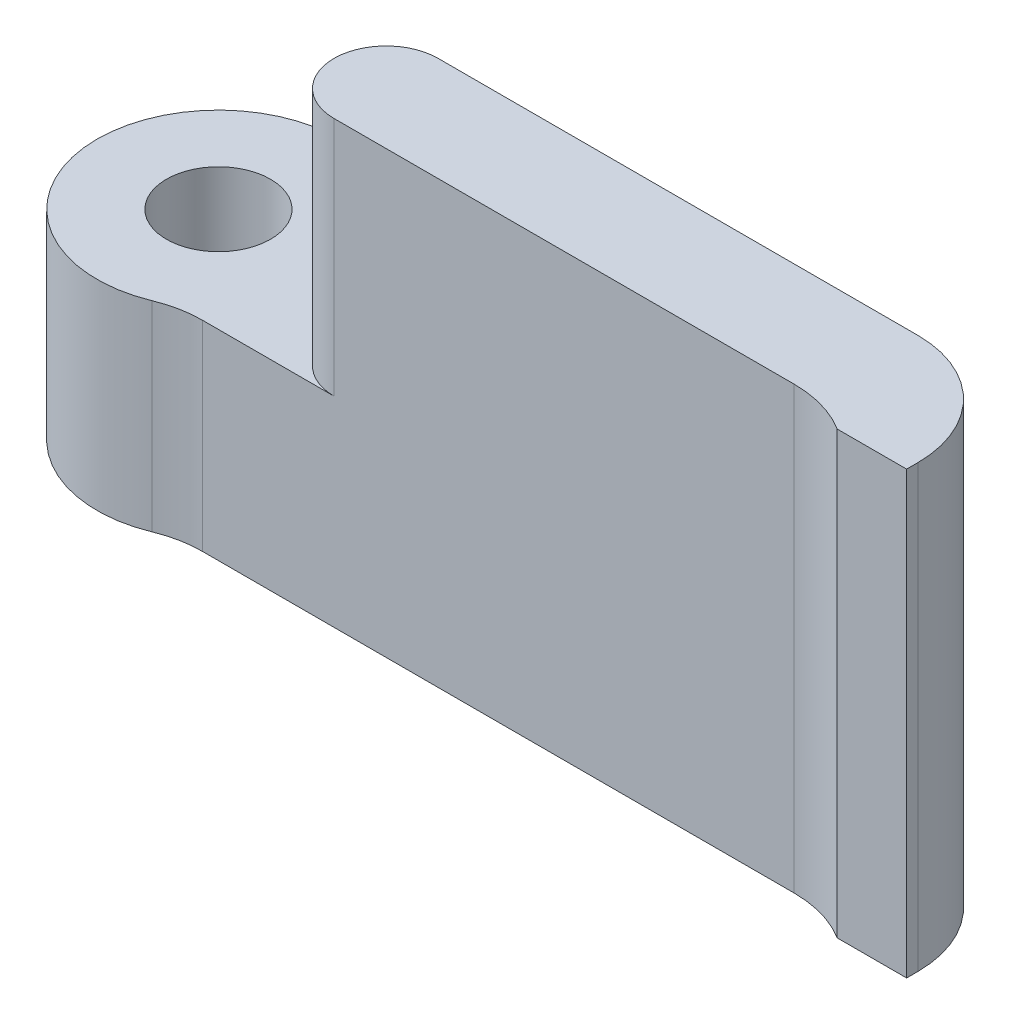
ISO-10303-21;
HEADER;
FILE_DESCRIPTION(('STEP AP214'),'2;1');
FILE_NAME('part.step','',(''),(''),'','','');
FILE_SCHEMA(('AUTOMOTIVE_DESIGN { 1 0 10303 214 1 1 1 1 }'));
ENDSEC;
DATA;
#1=APPLICATION_CONTEXT('core data for automotive mechanical design processes');
#2=APPLICATION_PROTOCOL_DEFINITION('international standard','automotive_design',2000,#1);
#3=PRODUCT_CONTEXT('',#1,'mechanical');
#4=PRODUCT('Part','Part','',(#3));
#5=PRODUCT_RELATED_PRODUCT_CATEGORY('part','',(#4));
#6=PRODUCT_DEFINITION_FORMATION('','',#4);
#7=PRODUCT_DEFINITION_CONTEXT('part definition',#1,'design');
#8=PRODUCT_DEFINITION('design','',#6,#7);
#9=PRODUCT_DEFINITION_SHAPE('','',#8);
#10=(LENGTH_UNIT() NAMED_UNIT(*) SI_UNIT(.MILLI.,.METRE.));
#11=(NAMED_UNIT(*) PLANE_ANGLE_UNIT() SI_UNIT($,.RADIAN.));
#12=(NAMED_UNIT(*) SI_UNIT($,.STERADIAN.) SOLID_ANGLE_UNIT());
#13=UNCERTAINTY_MEASURE_WITH_UNIT(LENGTH_MEASURE(1.E-05),#10,'distance_accuracy_value','');
#14=(GEOMETRIC_REPRESENTATION_CONTEXT(3) GLOBAL_UNCERTAINTY_ASSIGNED_CONTEXT((#13)) GLOBAL_UNIT_ASSIGNED_CONTEXT((#10,
#11,#12)) REPRESENTATION_CONTEXT('',''));
#15=CARTESIAN_POINT('',(0.,0.,0.));
#16=DIRECTION('',(0.,0.,1.));
#17=DIRECTION('',(1.,0.,0.));
#18=AXIS2_PLACEMENT_3D('',#15,#16,#17);
#19=CARTESIAN_POINT('',(0.,12.7,-10.));
#20=DIRECTION('',(0.,-1.,0.));
#21=DIRECTION('',(0.,0.,1.));
#22=AXIS2_PLACEMENT_3D('',#19,#20,#21);
#23=CYLINDRICAL_SURFACE('',#22,3.5);
#24=CARTESIAN_POINT('',(0.,5.77,-10.));
#25=DIRECTION('',(0.,1.,0.));
#26=DIRECTION('',(0.,0.,1.));
#27=AXIS2_PLACEMENT_3D('',#24,#25,#26);
#28=CIRCLE('',#27,3.5);
#29=CARTESIAN_POINT('',(3.07871091735214,5.77,-11.6647940074906));
#30=VERTEX_POINT('',#29);
#31=CARTESIAN_POINT('',(1.32908678635889,5.77,-6.76217228464419));
#32=VERTEX_POINT('',#31);
#33=EDGE_CURVE('E167',#30,#32,#28,.T.);
#34=ORIENTED_EDGE('',*,*,#33,.F.);
#35=DIRECTION('',(0.,-1.,0.));
#36=VECTOR('',#35,1.);
#37=CARTESIAN_POINT('',(3.07871091735214,12.7,-11.6647940074906));
#38=LINE('',#37,#36);
#39=CARTESIAN_POINT('',(3.07871091735214,0.,-11.6647940074906));
#40=VERTEX_POINT('',#39);
#41=EDGE_CURVE('E203',#30,#40,#38,.T.);
#42=ORIENTED_EDGE('',*,*,#41,.T.);
#43=CARTESIAN_POINT('',(0.,0.,-10.));
#44=DIRECTION('',(0.,-1.,0.));
#45=DIRECTION('',(0.,0.,-1.));
#46=AXIS2_PLACEMENT_3D('',#43,#44,#45);
#47=CIRCLE('',#46,3.5);
#48=CARTESIAN_POINT('',(1.32908678635889,0.,-6.76217228464419));
#49=VERTEX_POINT('',#48);
#50=EDGE_CURVE('E172',#49,#40,#47,.T.);
#51=ORIENTED_EDGE('',*,*,#50,.F.);
#52=DIRECTION('',(0.,-1.,0.));
#53=VECTOR('',#52,1.);
#54=CARTESIAN_POINT('',(1.32908678635889,12.7,-6.76217228464419));
#55=LINE('',#54,#53);
#56=EDGE_CURVE('E56',#49,#32,#55,.F.);
#57=ORIENTED_EDGE('',*,*,#56,.T.);
#58=EDGE_LOOP('',(#34,#42,#51,#57));
#59=FACE_BOUND('',#58,.T.);
#60=ADVANCED_FACE('F35',(#59),#23,.T.);
#61=CARTESIAN_POINT('',(0.,12.7,-10.));
#62=DIRECTION('',(0.,0.,1.));
#63=DIRECTION('',(-1.,0.,0.));
#64=AXIS2_PLACEMENT_3D('',#61,#62,#63);
#65=PLANE('',#64);
#66=DIRECTION('',(1.,0.,0.));
#67=VECTOR('',#66,1.);
#68=CARTESIAN_POINT('',(0.,12.7,-10.));
#69=LINE('',#68,#67);
#70=CARTESIAN_POINT('',(6.33021279348027,12.7,-10.));
#71=VERTEX_POINT('',#70);
#72=CARTESIAN_POINT('',(20.1552127934803,12.7,-10.));
#73=VERTEX_POINT('',#72);
#74=EDGE_CURVE('E173',#71,#73,#69,.T.);
#75=ORIENTED_EDGE('',*,*,#74,.T.);
#76=DIRECTION('',(0.,-1.,0.));
#77=VECTOR('',#76,1.);
#78=CARTESIAN_POINT('',(20.1552127934803,12.7,-10.));
#79=LINE('',#78,#77);
#80=CARTESIAN_POINT('',(20.1552127934803,0.,-10.));
#81=VERTEX_POINT('',#80);
#82=EDGE_CURVE('E193',#73,#81,#79,.T.);
#83=ORIENTED_EDGE('',*,*,#82,.T.);
#84=DIRECTION('',(1.,0.,0.));
#85=VECTOR('',#84,1.);
#86=CARTESIAN_POINT('',(0.,0.,-10.));
#87=LINE('',#86,#85);
#88=CARTESIAN_POINT('',(5.87154153523587,0.,-10.));
#89=VERTEX_POINT('',#88);
#90=EDGE_CURVE('E183',#89,#81,#87,.T.);
#91=ORIENTED_EDGE('',*,*,#90,.F.);
#92=DIRECTION('',(0.,1.,0.));
#93=VECTOR('',#92,1.);
#94=CARTESIAN_POINT('',(5.87154153523587,5.77,-10.));
#95=LINE('',#94,#93);
#96=CARTESIAN_POINT('',(5.87154153523587,5.77,-10.));
#97=VERTEX_POINT('',#96);
#98=EDGE_CURVE('E191',#89,#97,#95,.T.);
#99=ORIENTED_EDGE('',*,*,#98,.T.);
#100=DIRECTION('',(-1.,0.,0.));
#101=VECTOR('',#100,1.);
#102=CARTESIAN_POINT('',(0.,5.77,-10.));
#103=LINE('',#102,#101);
#104=CARTESIAN_POINT('',(6.33021279348027,5.77,-10.));
#105=VERTEX_POINT('',#104);
#106=EDGE_CURVE('E169',#105,#97,#103,.T.);
#107=ORIENTED_EDGE('',*,*,#106,.F.);
#108=DIRECTION('',(0.,1.,0.));
#109=VECTOR('',#108,1.);
#110=CARTESIAN_POINT('',(6.33021279348027,-12.0075208868195,-10.));
#111=LINE('',#110,#109);
#112=EDGE_CURVE('E164',#105,#71,#111,.T.);
#113=ORIENTED_EDGE('',*,*,#112,.T.);
#114=EDGE_LOOP('',(#75,#83,#91,#99,#107,#113));
#115=FACE_BOUND('',#114,.T.);
#116=ADVANCED_FACE('F228',(#115),#65,.F.);
#117=CARTESIAN_POINT('',(23.3302127934803,12.7,-10.));
#118=DIRECTION('',(-1.,0.,0.));
#119=DIRECTION('',(0.,0.,-1.));
#120=AXIS2_PLACEMENT_3D('',#117,#118,#119);
#121=PLANE('',#120);
#122=DIRECTION('',(0.,0.,1.));
#123=VECTOR('',#122,1.);
#124=CARTESIAN_POINT('',(23.3302127934803,0.,-10.));
#125=LINE('',#124,#123);
#126=CARTESIAN_POINT('',(23.3302127934803,0.,-6.825));
#127=VERTEX_POINT('',#126);
#128=CARTESIAN_POINT('',(23.3302127934803,0.,-6.5));
#129=VERTEX_POINT('',#128);
#130=EDGE_CURVE('E186',#127,#129,#125,.T.);
#131=ORIENTED_EDGE('',*,*,#130,.F.);
#132=DIRECTION('',(0.,-1.,0.));
#133=VECTOR('',#132,1.);
#134=CARTESIAN_POINT('',(23.3302127934803,12.7,-6.825));
#135=LINE('',#134,#133);
#136=CARTESIAN_POINT('',(23.3302127934803,12.7,-6.825));
#137=VERTEX_POINT('',#136);
#138=EDGE_CURVE('E198',#127,#137,#135,.F.);
#139=ORIENTED_EDGE('',*,*,#138,.T.);
#140=DIRECTION('',(0.,0.,1.));
#141=VECTOR('',#140,1.);
#142=CARTESIAN_POINT('',(23.3302127934803,12.7,-10.));
#143=LINE('',#142,#141);
#144=CARTESIAN_POINT('',(23.3302127934803,12.7,-6.5));
#145=VERTEX_POINT('',#144);
#146=EDGE_CURVE('E176',#137,#145,#143,.T.);
#147=ORIENTED_EDGE('',*,*,#146,.T.);
#148=DIRECTION('',(0.,1.,0.));
#149=VECTOR('',#148,1.);
#150=CARTESIAN_POINT('',(23.3302127934803,-3.77253374436471,-6.5));
#151=LINE('',#150,#149);
#152=EDGE_CURVE('E128',#129,#145,#151,.T.);
#153=ORIENTED_EDGE('',*,*,#152,.F.);
#154=EDGE_LOOP('',(#131,#139,#147,#153));
#155=FACE_BOUND('',#154,.T.);
#156=ADVANCED_FACE('F241',(#155),#121,.F.);
#157=CARTESIAN_POINT('',(0.,12.7,-7.));
#158=DIRECTION('',(0.,0.,-1.));
#159=DIRECTION('',(1.,0.,0.));
#160=AXIS2_PLACEMENT_3D('',#157,#158,#159);
#161=PLANE('',#160);
#162=DIRECTION('',(1.,0.,0.));
#163=VECTOR('',#162,1.);
#164=CARTESIAN_POINT('',(0.,5.77,-7.));
#165=LINE('',#164,#163);
#166=CARTESIAN_POINT('',(2.53475837112731,5.77,-7.));
#167=VERTEX_POINT('',#166);
#168=CARTESIAN_POINT('',(6.33021279348027,5.77,-7.));
#169=VERTEX_POINT('',#168);
#170=EDGE_CURVE('E180',#167,#169,#165,.T.);
#171=ORIENTED_EDGE('',*,*,#170,.F.);
#172=DIRECTION('',(0.,1.,0.));
#173=VECTOR('',#172,1.);
#174=CARTESIAN_POINT('',(2.53475837112731,0.,-7.));
#175=LINE('',#174,#173);
#176=CARTESIAN_POINT('',(2.53475837112731,0.,-7.));
#177=VERTEX_POINT('',#176);
#178=EDGE_CURVE('E206',#167,#177,#175,.F.);
#179=ORIENTED_EDGE('',*,*,#178,.T.);
#180=DIRECTION('',(-1.,0.,0.));
#181=VECTOR('',#180,1.);
#182=CARTESIAN_POINT('',(0.,0.,-7.));
#183=LINE('',#182,#181);
#184=CARTESIAN_POINT('',(19.5909600803877,0.,-7.));
#185=VERTEX_POINT('',#184);
#186=EDGE_CURVE('E177',#185,#177,#183,.T.);
#187=ORIENTED_EDGE('',*,*,#186,.F.);
#188=DIRECTION('',(0.,1.,0.));
#189=VECTOR('',#188,1.);
#190=CARTESIAN_POINT('',(19.5909600803877,-3.77253374436471,-7.));
#191=LINE('',#190,#189);
#192=CARTESIAN_POINT('',(19.5909600803877,12.7,-7.));
#193=VERTEX_POINT('',#192);
#194=EDGE_CURVE('E145',#185,#193,#191,.T.);
#195=ORIENTED_EDGE('',*,*,#194,.T.);
#196=DIRECTION('',(-1.,0.,0.));
#197=VECTOR('',#196,1.);
#198=CARTESIAN_POINT('',(0.,12.7,-7.));
#199=LINE('',#198,#197);
#200=CARTESIAN_POINT('',(6.33021279348027,12.7,-7.));
#201=VERTEX_POINT('',#200);
#202=EDGE_CURVE('E141',#193,#201,#199,.T.);
#203=ORIENTED_EDGE('',*,*,#202,.T.);
#204=DIRECTION('',(0.,1.,0.));
#205=VECTOR('',#204,1.);
#206=CARTESIAN_POINT('',(6.33021279348027,-12.0075208868195,-7.));
#207=LINE('',#206,#205);
#208=EDGE_CURVE('E161',#169,#201,#207,.T.);
#209=ORIENTED_EDGE('',*,*,#208,.F.);
#210=EDGE_LOOP('',(#171,#179,#187,#195,#203,#209));
#211=FACE_BOUND('',#210,.T.);
#212=ADVANCED_FACE('F219',(#211),#161,.F.);
#213=CARTESIAN_POINT('',(0.,12.7,-10.));
#214=DIRECTION('',(0.,1.,0.));
#215=DIRECTION('',(0.,0.,-1.));
#216=AXIS2_PLACEMENT_3D('',#213,#214,#215);
#217=PLANE('',#216);
#218=ORIENTED_EDGE('',*,*,#146,.F.);
#219=CARTESIAN_POINT('',(20.1552127934803,12.7,-6.825));
#220=DIRECTION('',(0.,1.,0.));
#221=DIRECTION('',(0.,0.,1.));
#222=AXIS2_PLACEMENT_3D('',#219,#220,#221);
#223=CIRCLE('',#222,3.175);
#224=EDGE_CURVE('E200',#137,#73,#223,.T.);
#225=ORIENTED_EDGE('',*,*,#224,.T.);
#226=ORIENTED_EDGE('',*,*,#74,.F.);
#227=CARTESIAN_POINT('',(6.33021279348027,12.7,-8.5));
#228=DIRECTION('',(0.,-1.,0.));
#229=DIRECTION('',(0.,0.,-1.));
#230=AXIS2_PLACEMENT_3D('',#227,#228,#229);
#231=CIRCLE('',#230,1.5);
#232=EDGE_CURVE('E153',#71,#201,#231,.F.);
#233=ORIENTED_EDGE('',*,*,#232,.T.);
#234=ORIENTED_EDGE('',*,*,#202,.F.);
#235=CARTESIAN_POINT('',(19.5909600803877,12.7,-3.725));
#236=DIRECTION('',(0.,1.,0.));
#237=DIRECTION('',(0.,0.,1.));
#238=AXIS2_PLACEMENT_3D('',#235,#236,#237);
#239=CIRCLE('',#238,3.275);
#240=CARTESIAN_POINT('',(21.3302127934803,12.7,-6.5));
#241=VERTEX_POINT('',#240);
#242=EDGE_CURVE('E122',#241,#193,#239,.T.);
#243=ORIENTED_EDGE('',*,*,#242,.F.);
#244=DIRECTION('',(-1.,0.,0.));
#245=VECTOR('',#244,1.);
#246=CARTESIAN_POINT('',(0.,12.7,-6.5));
#247=LINE('',#246,#245);
#248=EDGE_CURVE('E129',#145,#241,#247,.T.);
#249=ORIENTED_EDGE('',*,*,#248,.F.);
#250=EDGE_LOOP('',(#218,#225,#226,#233,#234,#243,#249));
#251=FACE_BOUND('',#250,.T.);
#252=ADVANCED_FACE('F139',(#251),#217,.T.);
#253=CARTESIAN_POINT('',(0.,0.,-10.));
#254=DIRECTION('',(0.,1.,0.));
#255=DIRECTION('',(0.,0.,-1.));
#256=AXIS2_PLACEMENT_3D('',#253,#254,#255);
#257=PLANE('',#256);
#258=CARTESIAN_POINT('',(0.,0.,-10.));
#259=DIRECTION('',(0.,-1.,0.));
#260=DIRECTION('',(0.,0.,-1.));
#261=AXIS2_PLACEMENT_3D('',#258,#259,#260);
#262=CIRCLE('',#261,1.5);
#263=CARTESIAN_POINT('',(0.,0.,-11.5));
#264=VERTEX_POINT('',#263);
#265=EDGE_CURVE('E150',#264,#264,#262,.T.);
#266=ORIENTED_EDGE('',*,*,#265,.F.);
#267=EDGE_LOOP('',(#266));
#268=FACE_BOUND('',#267,.T.);
#269=ORIENTED_EDGE('',*,*,#90,.T.);
#270=CARTESIAN_POINT('',(20.1552127934803,0.,-6.825));
#271=DIRECTION('',(0.,1.,0.));
#272=DIRECTION('',(0.,0.,1.));
#273=AXIS2_PLACEMENT_3D('',#270,#271,#272);
#274=CIRCLE('',#273,3.175);
#275=EDGE_CURVE('E196',#81,#127,#274,.F.);
#276=ORIENTED_EDGE('',*,*,#275,.T.);
#277=ORIENTED_EDGE('',*,*,#130,.T.);
#278=DIRECTION('',(1.,0.,0.));
#279=VECTOR('',#278,1.);
#280=CARTESIAN_POINT('',(0.,0.,-6.5));
#281=LINE('',#280,#279);
#282=CARTESIAN_POINT('',(21.3302127934803,0.,-6.5));
#283=VERTEX_POINT('',#282);
#284=EDGE_CURVE('E147',#283,#129,#281,.T.);
#285=ORIENTED_EDGE('',*,*,#284,.F.);
#286=CARTESIAN_POINT('',(19.5909600803877,0.,-3.725));
#287=DIRECTION('',(0.,1.,0.));
#288=DIRECTION('',(0.,0.,1.));
#289=AXIS2_PLACEMENT_3D('',#286,#287,#288);
#290=CIRCLE('',#289,3.275);
#291=EDGE_CURVE('E125',#185,#283,#290,.F.);
#292=ORIENTED_EDGE('',*,*,#291,.F.);
#293=ORIENTED_EDGE('',*,*,#186,.T.);
#294=CARTESIAN_POINT('',(2.53475837112731,0.,-3.825));
#295=DIRECTION('',(0.,1.,0.));
#296=DIRECTION('',(0.,0.,1.));
#297=AXIS2_PLACEMENT_3D('',#294,#295,#296);
#298=CIRCLE('',#297,3.175);
#299=EDGE_CURVE('E43',#177,#49,#298,.T.);
#300=ORIENTED_EDGE('',*,*,#299,.T.);
#301=ORIENTED_EDGE('',*,*,#50,.T.);
#302=CARTESIAN_POINT('',(5.87154153523587,0.,-13.175));
#303=DIRECTION('',(0.,1.,0.));
#304=DIRECTION('',(0.,0.,1.));
#305=AXIS2_PLACEMENT_3D('',#302,#303,#304);
#306=CIRCLE('',#305,3.175);
#307=EDGE_CURVE('E209',#40,#89,#306,.T.);
#308=ORIENTED_EDGE('',*,*,#307,.T.);
#309=EDGE_LOOP('',(#269,#276,#277,#285,#292,#293,#300,#301,#308));
#310=FACE_BOUND('',#309,.T.);
#311=ADVANCED_FACE('F213',(#268,#310),#257,.F.);
#312=CARTESIAN_POINT('',(0.,5.77,0.));
#313=DIRECTION('',(0.,-1.,0.));
#314=DIRECTION('',(-0.707106781186547,0.,0.707106781186548));
#315=AXIS2_PLACEMENT_3D('',#312,#313,#314);
#316=PLANE('',#315);
#317=CARTESIAN_POINT('',(0.,5.77,-10.));
#318=DIRECTION('',(0.,-1.,0.));
#319=DIRECTION('',(0.,0.,-1.));
#320=AXIS2_PLACEMENT_3D('',#317,#318,#319);
#321=CIRCLE('',#320,1.5);
#322=CARTESIAN_POINT('',(0.,5.77,-11.5));
#323=VERTEX_POINT('',#322);
#324=EDGE_CURVE('E154',#323,#323,#321,.T.);
#325=ORIENTED_EDGE('',*,*,#324,.T.);
#326=EDGE_LOOP('',(#325));
#327=FACE_BOUND('',#326,.T.);
#328=CARTESIAN_POINT('',(6.33021279348027,5.77,-8.5));
#329=DIRECTION('',(0.,1.,0.));
#330=DIRECTION('',(0.,0.,1.));
#331=AXIS2_PLACEMENT_3D('',#328,#329,#330);
#332=CIRCLE('',#331,1.5);
#333=EDGE_CURVE('E158',#105,#169,#332,.T.);
#334=ORIENTED_EDGE('',*,*,#333,.F.);
#335=ORIENTED_EDGE('',*,*,#106,.T.);
#336=CARTESIAN_POINT('',(5.87154153523587,5.77,-13.175));
#337=DIRECTION('',(0.,-1.,0.));
#338=DIRECTION('',(0.,0.,-1.));
#339=AXIS2_PLACEMENT_3D('',#336,#337,#338);
#340=CIRCLE('',#339,3.175);
#341=EDGE_CURVE('E211',#97,#30,#340,.T.);
#342=ORIENTED_EDGE('',*,*,#341,.T.);
#343=ORIENTED_EDGE('',*,*,#33,.T.);
#344=CARTESIAN_POINT('',(2.53475837112731,5.77,-3.825));
#345=DIRECTION('',(0.,-1.,0.));
#346=DIRECTION('',(0.,0.,-1.));
#347=AXIS2_PLACEMENT_3D('',#344,#345,#346);
#348=CIRCLE('',#347,3.175);
#349=EDGE_CURVE('E11',#32,#167,#348,.T.);
#350=ORIENTED_EDGE('',*,*,#349,.T.);
#351=ORIENTED_EDGE('',*,*,#170,.T.);
#352=EDGE_LOOP('',(#334,#335,#342,#343,#350,#351));
#353=FACE_BOUND('',#352,.T.);
#354=ADVANCED_FACE('F221',(#327,#353),#316,.F.);
#355=CARTESIAN_POINT('',(6.33021279348027,-12.0075208868195,-8.5));
#356=DIRECTION('',(0.,1.,0.));
#357=DIRECTION('',(0.,0.,-1.));
#358=AXIS2_PLACEMENT_3D('',#355,#356,#357);
#359=CYLINDRICAL_SURFACE('',#358,1.5);
#360=ORIENTED_EDGE('',*,*,#112,.F.);
#361=ORIENTED_EDGE('',*,*,#333,.T.);
#362=ORIENTED_EDGE('',*,*,#208,.T.);
#363=ORIENTED_EDGE('',*,*,#232,.F.);
#364=EDGE_LOOP('',(#360,#361,#362,#363));
#365=FACE_BOUND('',#364,.T.);
#366=ADVANCED_FACE('F225',(#365),#359,.T.);
#367=CARTESIAN_POINT('',(0.,0.,-10.));
#368=DIRECTION('',(0.,1.,0.));
#369=DIRECTION('',(0.,0.,-1.));
#370=AXIS2_PLACEMENT_3D('',#367,#368,#369);
#371=CYLINDRICAL_SURFACE('',#370,1.5);
#372=ORIENTED_EDGE('',*,*,#265,.T.);
#373=EDGE_LOOP('',(#372));
#374=FACE_BOUND('',#373,.T.);
#375=ORIENTED_EDGE('',*,*,#324,.F.);
#376=EDGE_LOOP('',(#375));
#377=FACE_BOUND('',#376,.T.);
#378=ADVANCED_FACE('F342',(#374,#377),#371,.F.);
#379=CARTESIAN_POINT('',(0.,-3.77253374436471,-6.5));
#380=DIRECTION('',(0.,0.,-1.));
#381=DIRECTION('',(-1.,0.,0.));
#382=AXIS2_PLACEMENT_3D('',#379,#380,#381);
#383=PLANE('',#382);
#384=DIRECTION('',(0.,1.,0.));
#385=VECTOR('',#384,1.);
#386=CARTESIAN_POINT('',(21.3302127934803,-3.77253374436471,-6.5));
#387=LINE('',#386,#385);
#388=EDGE_CURVE('E118',#283,#241,#387,.T.);
#389=ORIENTED_EDGE('',*,*,#388,.F.);
#390=ORIENTED_EDGE('',*,*,#284,.T.);
#391=ORIENTED_EDGE('',*,*,#152,.T.);
#392=ORIENTED_EDGE('',*,*,#248,.T.);
#393=EDGE_LOOP('',(#389,#390,#391,#392));
#394=FACE_BOUND('',#393,.T.);
#395=ADVANCED_FACE('F133',(#394),#383,.F.);
#396=CARTESIAN_POINT('',(19.5909600803877,-3.77253374436471,-3.725));
#397=DIRECTION('',(0.,1.,0.));
#398=DIRECTION('',(0.,0.,1.));
#399=AXIS2_PLACEMENT_3D('',#396,#397,#398);
#400=CYLINDRICAL_SURFACE('',#399,3.275);
#401=ORIENTED_EDGE('',*,*,#194,.F.);
#402=ORIENTED_EDGE('',*,*,#291,.T.);
#403=ORIENTED_EDGE('',*,*,#388,.T.);
#404=ORIENTED_EDGE('',*,*,#242,.T.);
#405=EDGE_LOOP('',(#401,#402,#403,#404));
#406=FACE_BOUND('',#405,.T.);
#407=ADVANCED_FACE('F120',(#406),#400,.F.);
#408=CARTESIAN_POINT('',(20.1552127934803,12.7,-6.825));
#409=DIRECTION('',(0.,-1.,0.));
#410=DIRECTION('',(0.,0.,-1.));
#411=AXIS2_PLACEMENT_3D('',#408,#409,#410);
#412=CYLINDRICAL_SURFACE('',#411,3.175);
#413=ORIENTED_EDGE('',*,*,#224,.F.);
#414=ORIENTED_EDGE('',*,*,#138,.F.);
#415=ORIENTED_EDGE('',*,*,#275,.F.);
#416=ORIENTED_EDGE('',*,*,#82,.F.);
#417=EDGE_LOOP('',(#413,#414,#415,#416));
#418=FACE_BOUND('',#417,.T.);
#419=ADVANCED_FACE('F237',(#418),#412,.T.);
#420=CARTESIAN_POINT('',(5.87154153523587,12.7,-13.175));
#421=DIRECTION('',(0.,-1.,0.));
#422=DIRECTION('',(0.,0.,-1.));
#423=AXIS2_PLACEMENT_3D('',#420,#421,#422);
#424=CYLINDRICAL_SURFACE('',#423,3.175);
#425=ORIENTED_EDGE('',*,*,#341,.F.);
#426=ORIENTED_EDGE('',*,*,#98,.F.);
#427=ORIENTED_EDGE('',*,*,#307,.F.);
#428=ORIENTED_EDGE('',*,*,#41,.F.);
#429=EDGE_LOOP('',(#425,#426,#427,#428));
#430=FACE_BOUND('',#429,.T.);
#431=ADVANCED_FACE('F234',(#430),#424,.F.);
#432=CARTESIAN_POINT('',(2.53475837112731,12.7,-3.825));
#433=DIRECTION('',(0.,-1.,0.));
#434=DIRECTION('',(0.,0.,-1.));
#435=AXIS2_PLACEMENT_3D('',#432,#433,#434);
#436=CYLINDRICAL_SURFACE('',#435,3.175);
#437=ORIENTED_EDGE('',*,*,#349,.F.);
#438=ORIENTED_EDGE('',*,*,#56,.F.);
#439=ORIENTED_EDGE('',*,*,#299,.F.);
#440=ORIENTED_EDGE('',*,*,#178,.F.);
#441=EDGE_LOOP('',(#437,#438,#439,#440));
#442=FACE_BOUND('',#441,.T.);
#443=ADVANCED_FACE('F37',(#442),#436,.F.);
#444=CLOSED_SHELL('',(#60,#116,#156,#212,#252,#311,#354,#366,#378,#395,#407,#419,#431,#443));
#445=MANIFOLD_SOLID_BREP('B2',#444);
#446=ADVANCED_BREP_SHAPE_REPRESENTATION('',(#18,#445),#14);
#447=SHAPE_DEFINITION_REPRESENTATION(#9,#446);
ENDSEC;
END-ISO-10303-21;
